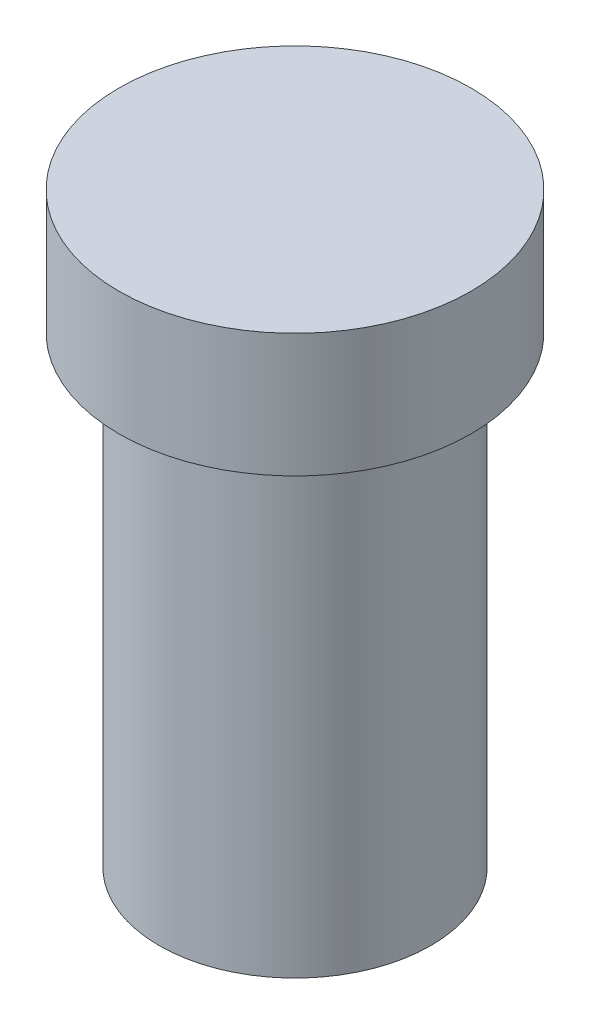
ISO-10303-21;
HEADER;
FILE_DESCRIPTION(('STEP AP214'),'2;1');
FILE_NAME('part.step','',(''),(''),'','','');
FILE_SCHEMA(('AUTOMOTIVE_DESIGN { 1 0 10303 214 1 1 1 1 }'));
ENDSEC;
DATA;
#1=APPLICATION_CONTEXT('core data for automotive mechanical design processes');
#2=APPLICATION_PROTOCOL_DEFINITION('international standard','automotive_design',2000,#1);
#3=PRODUCT_CONTEXT('',#1,'mechanical');
#4=PRODUCT('Part','Part','',(#3));
#5=PRODUCT_RELATED_PRODUCT_CATEGORY('part','',(#4));
#6=PRODUCT_DEFINITION_FORMATION('','',#4);
#7=PRODUCT_DEFINITION_CONTEXT('part definition',#1,'design');
#8=PRODUCT_DEFINITION('design','',#6,#7);
#9=PRODUCT_DEFINITION_SHAPE('','',#8);
#10=(LENGTH_UNIT() NAMED_UNIT(*) SI_UNIT(.MILLI.,.METRE.));
#11=(NAMED_UNIT(*) PLANE_ANGLE_UNIT() SI_UNIT($,.RADIAN.));
#12=(NAMED_UNIT(*) SI_UNIT($,.STERADIAN.) SOLID_ANGLE_UNIT());
#13=UNCERTAINTY_MEASURE_WITH_UNIT(LENGTH_MEASURE(1.E-05),#10,'distance_accuracy_value','');
#14=(GEOMETRIC_REPRESENTATION_CONTEXT(3) GLOBAL_UNCERTAINTY_ASSIGNED_CONTEXT((#13)) GLOBAL_UNIT_ASSIGNED_CONTEXT((#10,
#11,#12)) REPRESENTATION_CONTEXT('',''));
#15=CARTESIAN_POINT('',(0.,0.,0.));
#16=DIRECTION('',(0.,0.,1.));
#17=DIRECTION('',(1.,0.,0.));
#18=AXIS2_PLACEMENT_3D('',#15,#16,#17);
#19=CARTESIAN_POINT('',(0.,-20.,0.));
#20=DIRECTION('',(0.,1.,0.));
#21=DIRECTION('',(0.,0.,1.));
#22=AXIS2_PLACEMENT_3D('',#19,#20,#21);
#23=PLANE('',#22);
#24=CARTESIAN_POINT('',(0.,-20.,0.));
#25=DIRECTION('',(0.,1.,0.));
#26=DIRECTION('',(0.,0.,1.));
#27=AXIS2_PLACEMENT_3D('',#24,#25,#26);
#28=CIRCLE('',#27,28.5);
#29=CARTESIAN_POINT('',(0.,-20.,28.5));
#30=VERTEX_POINT('',#29);
#31=EDGE_CURVE('E40',#30,#30,#28,.T.);
#32=ORIENTED_EDGE('',*,*,#31,.F.);
#33=EDGE_LOOP('',(#32));
#34=FACE_BOUND('',#33,.T.);
#35=CARTESIAN_POINT('',(0.,-20.,0.));
#36=DIRECTION('',(0.,1.,0.));
#37=DIRECTION('',(0.,0.,1.));
#38=AXIS2_PLACEMENT_3D('',#35,#36,#37);
#39=CIRCLE('',#38,22.);
#40=CARTESIAN_POINT('',(0.,-20.,22.));
#41=VERTEX_POINT('',#40);
#42=EDGE_CURVE('E10',#41,#41,#39,.F.);
#43=ORIENTED_EDGE('',*,*,#42,.F.);
#44=EDGE_LOOP('',(#43));
#45=FACE_BOUND('',#44,.T.);
#46=ADVANCED_FACE('F33',(#34,#45),#23,.F.);
#47=CARTESIAN_POINT('',(0.,-20.,0.));
#48=DIRECTION('',(0.,1.,0.));
#49=DIRECTION('',(0.,0.,1.));
#50=AXIS2_PLACEMENT_3D('',#47,#48,#49);
#51=CYLINDRICAL_SURFACE('',#50,28.5);
#52=ORIENTED_EDGE('',*,*,#31,.T.);
#53=EDGE_LOOP('',(#52));
#54=FACE_BOUND('',#53,.T.);
#55=CARTESIAN_POINT('',(0.,0.,0.));
#56=DIRECTION('',(0.,1.,0.));
#57=DIRECTION('',(0.,0.,1.));
#58=AXIS2_PLACEMENT_3D('',#55,#56,#57);
#59=CIRCLE('',#58,28.5);
#60=CARTESIAN_POINT('',(0.,0.,28.5));
#61=VERTEX_POINT('',#60);
#62=EDGE_CURVE('E44',#61,#61,#59,.T.);
#63=ORIENTED_EDGE('',*,*,#62,.F.);
#64=EDGE_LOOP('',(#63));
#65=FACE_BOUND('',#64,.T.);
#66=ADVANCED_FACE('F35',(#54,#65),#51,.T.);
#67=CARTESIAN_POINT('',(0.,0.,0.));
#68=DIRECTION('',(0.,1.,0.));
#69=DIRECTION('',(0.,0.,1.));
#70=AXIS2_PLACEMENT_3D('',#67,#68,#69);
#71=PLANE('',#70);
#72=ORIENTED_EDGE('',*,*,#62,.T.);
#73=EDGE_LOOP('',(#72));
#74=FACE_BOUND('',#73,.T.);
#75=ADVANCED_FACE('F58',(#74),#71,.T.);
#76=CARTESIAN_POINT('',(0.,-95.,0.));
#77=DIRECTION('',(0.,1.,0.));
#78=DIRECTION('',(0.,0.,1.));
#79=AXIS2_PLACEMENT_3D('',#76,#77,#78);
#80=CYLINDRICAL_SURFACE('',#79,22.);
#81=CARTESIAN_POINT('',(0.,-95.,0.));
#82=DIRECTION('',(0.,-1.,0.));
#83=DIRECTION('',(0.,0.,-1.));
#84=AXIS2_PLACEMENT_3D('',#81,#82,#83);
#85=CIRCLE('',#84,22.);
#86=CARTESIAN_POINT('',(0.,-95.,-22.));
#87=VERTEX_POINT('',#86);
#88=EDGE_CURVE('E49',#87,#87,#85,.T.);
#89=ORIENTED_EDGE('',*,*,#88,.F.);
#90=EDGE_LOOP('',(#89));
#91=FACE_BOUND('',#90,.T.);
#92=ORIENTED_EDGE('',*,*,#42,.T.);
#93=EDGE_LOOP('',(#92));
#94=FACE_BOUND('',#93,.T.);
#95=ADVANCED_FACE('F56',(#91,#94),#80,.T.);
#96=CARTESIAN_POINT('',(0.,-95.,0.));
#97=DIRECTION('',(0.,-1.,0.));
#98=DIRECTION('',(0.,0.,-1.));
#99=AXIS2_PLACEMENT_3D('',#96,#97,#98);
#100=PLANE('',#99);
#101=ORIENTED_EDGE('',*,*,#88,.T.);
#102=EDGE_LOOP('',(#101));
#103=FACE_BOUND('',#102,.T.);
#104=ADVANCED_FACE('F54',(#103),#100,.T.);
#105=CLOSED_SHELL('',(#46,#66,#75,#95,#104));
#106=MANIFOLD_SOLID_BREP('B2',#105);
#107=ADVANCED_BREP_SHAPE_REPRESENTATION('',(#18,#106),#14);
#108=SHAPE_DEFINITION_REPRESENTATION(#9,#107);
ENDSEC;
END-ISO-10303-21;
